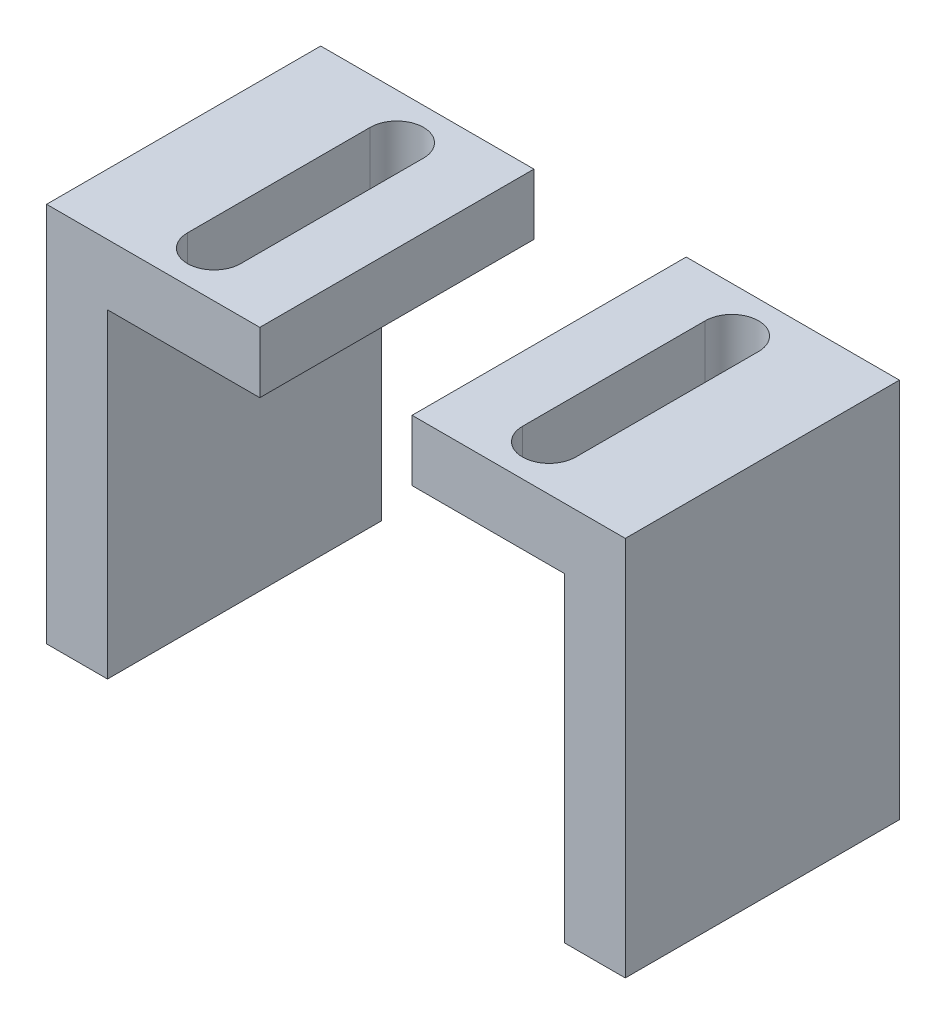
ISO-10303-21;
HEADER;
FILE_DESCRIPTION(('STEP AP214'),'2;1');
FILE_NAME('part.step','',(''),(''),'','','');
FILE_SCHEMA(('AUTOMOTIVE_DESIGN { 1 0 10303 214 1 1 1 1 }'));
ENDSEC;
DATA;
#1=APPLICATION_CONTEXT('core data for automotive mechanical design processes');
#2=APPLICATION_PROTOCOL_DEFINITION('international standard','automotive_design',2000,#1);
#3=PRODUCT_CONTEXT('',#1,'mechanical');
#4=PRODUCT('Part','Part','',(#3));
#5=PRODUCT_RELATED_PRODUCT_CATEGORY('part','',(#4));
#6=PRODUCT_DEFINITION_FORMATION('','',#4);
#7=PRODUCT_DEFINITION_CONTEXT('part definition',#1,'design');
#8=PRODUCT_DEFINITION('design','',#6,#7);
#9=PRODUCT_DEFINITION_SHAPE('','',#8);
#10=(LENGTH_UNIT() NAMED_UNIT(*) SI_UNIT(.MILLI.,.METRE.));
#11=(NAMED_UNIT(*) PLANE_ANGLE_UNIT() SI_UNIT($,.RADIAN.));
#12=(NAMED_UNIT(*) SI_UNIT($,.STERADIAN.) SOLID_ANGLE_UNIT());
#13=UNCERTAINTY_MEASURE_WITH_UNIT(LENGTH_MEASURE(1.E-05),#10,'distance_accuracy_value','');
#14=(GEOMETRIC_REPRESENTATION_CONTEXT(3) GLOBAL_UNCERTAINTY_ASSIGNED_CONTEXT((#13)) GLOBAL_UNIT_ASSIGNED_CONTEXT((#10,
#11,#12)) REPRESENTATION_CONTEXT('',''));
#15=CARTESIAN_POINT('',(0.,0.,0.));
#16=DIRECTION('',(0.,0.,1.));
#17=DIRECTION('',(1.,0.,0.));
#18=AXIS2_PLACEMENT_3D('',#15,#16,#17);
#19=CARTESIAN_POINT('',(10.,4.,18.));
#20=DIRECTION('',(1.,0.,0.));
#21=DIRECTION('',(0.,-1.,0.));
#22=AXIS2_PLACEMENT_3D('',#19,#20,#21);
#23=PLANE('',#22);
#24=DIRECTION('',(0.,1.,0.));
#25=VECTOR('',#24,1.);
#26=CARTESIAN_POINT('',(10.,4.,0.));
#27=LINE('',#26,#25);
#28=CARTESIAN_POINT('',(10.,0.,0.));
#29=VERTEX_POINT('',#28);
#30=CARTESIAN_POINT('',(10.,4.,0.));
#31=VERTEX_POINT('',#30);
#32=EDGE_CURVE('E143',#29,#31,#27,.T.);
#33=ORIENTED_EDGE('',*,*,#32,.F.);
#34=DIRECTION('',(0.,0.,-1.));
#35=VECTOR('',#34,1.);
#36=CARTESIAN_POINT('',(10.,0.,18.));
#37=LINE('',#36,#35);
#38=CARTESIAN_POINT('',(10.,0.,18.));
#39=VERTEX_POINT('',#38);
#40=EDGE_CURVE('E164',#39,#29,#37,.T.);
#41=ORIENTED_EDGE('',*,*,#40,.F.);
#42=DIRECTION('',(0.,1.,0.));
#43=VECTOR('',#42,1.);
#44=CARTESIAN_POINT('',(10.,4.,18.));
#45=LINE('',#44,#43);
#46=CARTESIAN_POINT('',(10.,4.,18.));
#47=VERTEX_POINT('',#46);
#48=EDGE_CURVE('E146',#39,#47,#45,.T.);
#49=ORIENTED_EDGE('',*,*,#48,.T.);
#50=DIRECTION('',(0.,0.,-1.));
#51=VECTOR('',#50,1.);
#52=CARTESIAN_POINT('',(10.,4.,18.));
#53=LINE('',#52,#51);
#54=EDGE_CURVE('E194',#47,#31,#53,.T.);
#55=ORIENTED_EDGE('',*,*,#54,.T.);
#56=EDGE_LOOP('',(#33,#41,#49,#55));
#57=FACE_BOUND('',#56,.T.);
#58=ADVANCED_FACE('F42',(#57),#23,.F.);
#59=CARTESIAN_POINT('',(24.,4.,18.));
#60=DIRECTION('',(0.,-1.,0.));
#61=DIRECTION('',(0.,0.,-1.));
#62=AXIS2_PLACEMENT_3D('',#59,#60,#61);
#63=PLANE('',#62);
#64=DIRECTION('',(0.,0.,1.));
#65=VECTOR('',#64,1.);
#66=CARTESIAN_POINT('',(17.75,4.,3.));
#67=LINE('',#66,#65);
#68=CARTESIAN_POINT('',(17.75,4.,3.));
#69=VERTEX_POINT('',#68);
#70=CARTESIAN_POINT('',(17.75,4.,15.));
#71=VERTEX_POINT('',#70);
#72=EDGE_CURVE('E120',#69,#71,#67,.T.);
#73=ORIENTED_EDGE('',*,*,#72,.T.);
#74=CARTESIAN_POINT('',(16.,4.,15.));
#75=DIRECTION('',(0.,-1.,0.));
#76=DIRECTION('',(0.,0.,1.));
#77=AXIS2_PLACEMENT_3D('',#74,#75,#76);
#78=CIRCLE('',#77,1.75);
#79=CARTESIAN_POINT('',(14.25,4.,15.));
#80=VERTEX_POINT('',#79);
#81=EDGE_CURVE('E127',#71,#80,#78,.T.);
#82=ORIENTED_EDGE('',*,*,#81,.T.);
#83=DIRECTION('',(0.,0.,-1.));
#84=VECTOR('',#83,1.);
#85=CARTESIAN_POINT('',(14.25,4.,3.));
#86=LINE('',#85,#84);
#87=CARTESIAN_POINT('',(14.25,4.,3.));
#88=VERTEX_POINT('',#87);
#89=EDGE_CURVE('E132',#80,#88,#86,.T.);
#90=ORIENTED_EDGE('',*,*,#89,.T.);
#91=CARTESIAN_POINT('',(16.,4.,3.));
#92=DIRECTION('',(0.,-1.,0.));
#93=DIRECTION('',(0.,0.,1.));
#94=AXIS2_PLACEMENT_3D('',#91,#92,#93);
#95=CIRCLE('',#94,1.75);
#96=EDGE_CURVE('E136',#88,#69,#95,.T.);
#97=ORIENTED_EDGE('',*,*,#96,.T.);
#98=EDGE_LOOP('',(#73,#82,#90,#97));
#99=FACE_BOUND('',#98,.T.);
#100=DIRECTION('',(1.,0.,0.));
#101=VECTOR('',#100,1.);
#102=CARTESIAN_POINT('',(24.,4.,0.));
#103=LINE('',#102,#101);
#104=CARTESIAN_POINT('',(24.,4.,0.));
#105=VERTEX_POINT('',#104);
#106=EDGE_CURVE('E167',#31,#105,#103,.T.);
#107=ORIENTED_EDGE('',*,*,#106,.F.);
#108=ORIENTED_EDGE('',*,*,#54,.F.);
#109=DIRECTION('',(1.,0.,0.));
#110=VECTOR('',#109,1.);
#111=CARTESIAN_POINT('',(24.,4.,18.));
#112=LINE('',#111,#110);
#113=CARTESIAN_POINT('',(24.,4.,18.));
#114=VERTEX_POINT('',#113);
#115=EDGE_CURVE('E149',#47,#114,#112,.T.);
#116=ORIENTED_EDGE('',*,*,#115,.T.);
#117=DIRECTION('',(0.,0.,-1.));
#118=VECTOR('',#117,1.);
#119=CARTESIAN_POINT('',(24.,4.,18.));
#120=LINE('',#119,#118);
#121=EDGE_CURVE('E191',#114,#105,#120,.T.);
#122=ORIENTED_EDGE('',*,*,#121,.T.);
#123=EDGE_LOOP('',(#107,#108,#116,#122));
#124=FACE_BOUND('',#123,.T.);
#125=ADVANCED_FACE('F134',(#99,#124),#63,.F.);
#126=CARTESIAN_POINT('',(24.,-21.,18.));
#127=DIRECTION('',(-1.,0.,0.));
#128=DIRECTION('',(0.,0.,-1.));
#129=AXIS2_PLACEMENT_3D('',#126,#127,#128);
#130=PLANE('',#129);
#131=DIRECTION('',(0.,-1.,0.));
#132=VECTOR('',#131,1.);
#133=CARTESIAN_POINT('',(24.,-21.,0.));
#134=LINE('',#133,#132);
#135=CARTESIAN_POINT('',(24.,-21.,0.));
#136=VERTEX_POINT('',#135);
#137=EDGE_CURVE('E170',#105,#136,#134,.T.);
#138=ORIENTED_EDGE('',*,*,#137,.F.);
#139=ORIENTED_EDGE('',*,*,#121,.F.);
#140=DIRECTION('',(0.,-1.,0.));
#141=VECTOR('',#140,1.);
#142=CARTESIAN_POINT('',(24.,-21.,18.));
#143=LINE('',#142,#141);
#144=CARTESIAN_POINT('',(24.,-21.,18.));
#145=VERTEX_POINT('',#144);
#146=EDGE_CURVE('E153',#114,#145,#143,.T.);
#147=ORIENTED_EDGE('',*,*,#146,.T.);
#148=DIRECTION('',(0.,0.,-1.));
#149=VECTOR('',#148,1.);
#150=CARTESIAN_POINT('',(24.,-21.,18.));
#151=LINE('',#150,#149);
#152=EDGE_CURVE('E188',#145,#136,#151,.T.);
#153=ORIENTED_EDGE('',*,*,#152,.T.);
#154=EDGE_LOOP('',(#138,#139,#147,#153));
#155=FACE_BOUND('',#154,.T.);
#156=ADVANCED_FACE('F226',(#155),#130,.F.);
#157=CARTESIAN_POINT('',(20.,-21.,18.));
#158=DIRECTION('',(0.,1.,0.));
#159=DIRECTION('',(1.,0.,0.));
#160=AXIS2_PLACEMENT_3D('',#157,#158,#159);
#161=PLANE('',#160);
#162=DIRECTION('',(-1.,0.,0.));
#163=VECTOR('',#162,1.);
#164=CARTESIAN_POINT('',(20.,-21.,0.));
#165=LINE('',#164,#163);
#166=CARTESIAN_POINT('',(20.,-21.,0.));
#167=VERTEX_POINT('',#166);
#168=EDGE_CURVE('E173',#136,#167,#165,.T.);
#169=ORIENTED_EDGE('',*,*,#168,.F.);
#170=ORIENTED_EDGE('',*,*,#152,.F.);
#171=DIRECTION('',(-1.,0.,0.));
#172=VECTOR('',#171,1.);
#173=CARTESIAN_POINT('',(20.,-21.,18.));
#174=LINE('',#173,#172);
#175=CARTESIAN_POINT('',(20.,-21.,18.));
#176=VERTEX_POINT('',#175);
#177=EDGE_CURVE('E156',#145,#176,#174,.T.);
#178=ORIENTED_EDGE('',*,*,#177,.T.);
#179=DIRECTION('',(0.,0.,-1.));
#180=VECTOR('',#179,1.);
#181=CARTESIAN_POINT('',(20.,-21.,18.));
#182=LINE('',#181,#180);
#183=EDGE_CURVE('E185',#176,#167,#182,.T.);
#184=ORIENTED_EDGE('',*,*,#183,.T.);
#185=EDGE_LOOP('',(#169,#170,#178,#184));
#186=FACE_BOUND('',#185,.T.);
#187=ADVANCED_FACE('F237',(#186),#161,.F.);
#188=CARTESIAN_POINT('',(20.,0.,18.));
#189=DIRECTION('',(1.,0.,0.));
#190=DIRECTION('',(0.,-1.,0.));
#191=AXIS2_PLACEMENT_3D('',#188,#189,#190);
#192=PLANE('',#191);
#193=DIRECTION('',(0.,1.,0.));
#194=VECTOR('',#193,1.);
#195=CARTESIAN_POINT('',(20.,0.,0.));
#196=LINE('',#195,#194);
#197=CARTESIAN_POINT('',(20.,0.,0.));
#198=VERTEX_POINT('',#197);
#199=EDGE_CURVE('E176',#167,#198,#196,.T.);
#200=ORIENTED_EDGE('',*,*,#199,.F.);
#201=ORIENTED_EDGE('',*,*,#183,.F.);
#202=DIRECTION('',(0.,1.,0.));
#203=VECTOR('',#202,1.);
#204=CARTESIAN_POINT('',(20.,0.,18.));
#205=LINE('',#204,#203);
#206=CARTESIAN_POINT('',(20.,0.,18.));
#207=VERTEX_POINT('',#206);
#208=EDGE_CURVE('E159',#176,#207,#205,.T.);
#209=ORIENTED_EDGE('',*,*,#208,.T.);
#210=DIRECTION('',(0.,0.,-1.));
#211=VECTOR('',#210,1.);
#212=CARTESIAN_POINT('',(20.,0.,18.));
#213=LINE('',#212,#211);
#214=EDGE_CURVE('E182',#207,#198,#213,.T.);
#215=ORIENTED_EDGE('',*,*,#214,.T.);
#216=EDGE_LOOP('',(#200,#201,#209,#215));
#217=FACE_BOUND('',#216,.T.);
#218=ADVANCED_FACE('F240',(#217),#192,.F.);
#219=CARTESIAN_POINT('',(10.,0.,18.));
#220=DIRECTION('',(0.,1.,0.));
#221=DIRECTION('',(1.,0.,0.));
#222=AXIS2_PLACEMENT_3D('',#219,#220,#221);
#223=PLANE('',#222);
#224=DIRECTION('',(0.,0.,-1.));
#225=VECTOR('',#224,1.);
#226=CARTESIAN_POINT('',(14.25,0.,18.));
#227=LINE('',#226,#225);
#228=CARTESIAN_POINT('',(14.25,0.,15.));
#229=VERTEX_POINT('',#228);
#230=CARTESIAN_POINT('',(14.25,0.,3.));
#231=VERTEX_POINT('',#230);
#232=EDGE_CURVE('E49',#229,#231,#227,.T.);
#233=ORIENTED_EDGE('',*,*,#232,.F.);
#234=CARTESIAN_POINT('',(16.,0.,15.));
#235=DIRECTION('',(0.,-1.,0.));
#236=DIRECTION('',(1.,0.,0.));
#237=AXIS2_PLACEMENT_3D('',#234,#235,#236);
#238=CIRCLE('',#237,1.75);
#239=CARTESIAN_POINT('',(17.75,0.,15.));
#240=VERTEX_POINT('',#239);
#241=EDGE_CURVE('E198',#240,#229,#238,.T.);
#242=ORIENTED_EDGE('',*,*,#241,.F.);
#243=DIRECTION('',(0.,0.,1.));
#244=VECTOR('',#243,1.);
#245=CARTESIAN_POINT('',(17.75,0.,18.));
#246=LINE('',#245,#244);
#247=CARTESIAN_POINT('',(17.75,0.,3.));
#248=VERTEX_POINT('',#247);
#249=EDGE_CURVE('E122',#248,#240,#246,.T.);
#250=ORIENTED_EDGE('',*,*,#249,.F.);
#251=CARTESIAN_POINT('',(16.,0.,3.));
#252=DIRECTION('',(0.,-1.,0.));
#253=DIRECTION('',(1.,0.,0.));
#254=AXIS2_PLACEMENT_3D('',#251,#252,#253);
#255=CIRCLE('',#254,1.75);
#256=EDGE_CURVE('E12',#231,#248,#255,.T.);
#257=ORIENTED_EDGE('',*,*,#256,.F.);
#258=EDGE_LOOP('',(#233,#242,#250,#257));
#259=FACE_BOUND('',#258,.T.);
#260=DIRECTION('',(-1.,0.,0.));
#261=VECTOR('',#260,1.);
#262=CARTESIAN_POINT('',(10.,0.,0.));
#263=LINE('',#262,#261);
#264=EDGE_CURVE('E150',#198,#29,#263,.T.);
#265=ORIENTED_EDGE('',*,*,#264,.F.);
#266=ORIENTED_EDGE('',*,*,#214,.F.);
#267=DIRECTION('',(-1.,0.,0.));
#268=VECTOR('',#267,1.);
#269=CARTESIAN_POINT('',(10.,0.,18.));
#270=LINE('',#269,#268);
#271=EDGE_CURVE('E162',#207,#39,#270,.T.);
#272=ORIENTED_EDGE('',*,*,#271,.T.);
#273=ORIENTED_EDGE('',*,*,#40,.T.);
#274=EDGE_LOOP('',(#265,#266,#272,#273));
#275=FACE_BOUND('',#274,.T.);
#276=ADVANCED_FACE('F205',(#259,#275),#223,.F.);
#277=CARTESIAN_POINT('',(10.,0.,18.));
#278=DIRECTION('',(0.,0.,-1.));
#279=DIRECTION('',(1.,0.,0.));
#280=AXIS2_PLACEMENT_3D('',#277,#278,#279);
#281=PLANE('',#280);
#282=ORIENTED_EDGE('',*,*,#48,.F.);
#283=ORIENTED_EDGE('',*,*,#271,.F.);
#284=ORIENTED_EDGE('',*,*,#208,.F.);
#285=ORIENTED_EDGE('',*,*,#177,.F.);
#286=ORIENTED_EDGE('',*,*,#146,.F.);
#287=ORIENTED_EDGE('',*,*,#115,.F.);
#288=EDGE_LOOP('',(#282,#283,#284,#285,#286,#287));
#289=FACE_BOUND('',#288,.T.);
#290=ADVANCED_FACE('F216',(#289),#281,.F.);
#291=CARTESIAN_POINT('',(10.,0.,0.));
#292=DIRECTION('',(0.,0.,-1.));
#293=DIRECTION('',(1.,0.,0.));
#294=AXIS2_PLACEMENT_3D('',#291,#292,#293);
#295=PLANE('',#294);
#296=ORIENTED_EDGE('',*,*,#32,.T.);
#297=ORIENTED_EDGE('',*,*,#106,.T.);
#298=ORIENTED_EDGE('',*,*,#137,.T.);
#299=ORIENTED_EDGE('',*,*,#168,.T.);
#300=ORIENTED_EDGE('',*,*,#199,.T.);
#301=ORIENTED_EDGE('',*,*,#264,.T.);
#302=EDGE_LOOP('',(#296,#297,#298,#299,#300,#301));
#303=FACE_BOUND('',#302,.T.);
#304=ADVANCED_FACE('F209',(#303),#295,.T.);
#305=CARTESIAN_POINT('',(16.,-14.,3.));
#306=DIRECTION('',(0.,1.,0.));
#307=DIRECTION('',(0.,0.,1.));
#308=AXIS2_PLACEMENT_3D('',#305,#306,#307);
#309=CYLINDRICAL_SURFACE('',#308,1.75);
#310=DIRECTION('',(0.,1.,0.));
#311=VECTOR('',#310,1.);
#312=CARTESIAN_POINT('',(14.25,-14.,3.));
#313=LINE('',#312,#311);
#314=EDGE_CURVE('E141',#231,#88,#313,.T.);
#315=ORIENTED_EDGE('',*,*,#314,.F.);
#316=ORIENTED_EDGE('',*,*,#256,.T.);
#317=DIRECTION('',(0.,1.,0.));
#318=VECTOR('',#317,1.);
#319=CARTESIAN_POINT('',(17.75,-14.,3.));
#320=LINE('',#319,#318);
#321=EDGE_CURVE('E55',#248,#69,#320,.T.);
#322=ORIENTED_EDGE('',*,*,#321,.T.);
#323=ORIENTED_EDGE('',*,*,#96,.F.);
#324=EDGE_LOOP('',(#315,#316,#322,#323));
#325=FACE_BOUND('',#324,.T.);
#326=ADVANCED_FACE('F207',(#325),#309,.F.);
#327=CARTESIAN_POINT('',(14.25,-14.,3.));
#328=DIRECTION('',(-1.,0.,0.));
#329=DIRECTION('',(0.,0.,-1.));
#330=AXIS2_PLACEMENT_3D('',#327,#328,#329);
#331=PLANE('',#330);
#332=DIRECTION('',(0.,1.,0.));
#333=VECTOR('',#332,1.);
#334=CARTESIAN_POINT('',(14.25,-14.,15.));
#335=LINE('',#334,#333);
#336=EDGE_CURVE('E124',#229,#80,#335,.T.);
#337=ORIENTED_EDGE('',*,*,#336,.F.);
#338=ORIENTED_EDGE('',*,*,#232,.T.);
#339=ORIENTED_EDGE('',*,*,#314,.T.);
#340=ORIENTED_EDGE('',*,*,#89,.F.);
#341=EDGE_LOOP('',(#337,#338,#339,#340));
#342=FACE_BOUND('',#341,.T.);
#343=ADVANCED_FACE('F202',(#342),#331,.F.);
#344=CARTESIAN_POINT('',(16.,-14.,15.));
#345=DIRECTION('',(0.,1.,0.));
#346=DIRECTION('',(0.,0.,1.));
#347=AXIS2_PLACEMENT_3D('',#344,#345,#346);
#348=CYLINDRICAL_SURFACE('',#347,1.75);
#349=DIRECTION('',(0.,1.,0.));
#350=VECTOR('',#349,1.);
#351=CARTESIAN_POINT('',(17.75,-14.,15.));
#352=LINE('',#351,#350);
#353=EDGE_CURVE('E63',#240,#71,#352,.T.);
#354=ORIENTED_EDGE('',*,*,#353,.F.);
#355=ORIENTED_EDGE('',*,*,#241,.T.);
#356=ORIENTED_EDGE('',*,*,#336,.T.);
#357=ORIENTED_EDGE('',*,*,#81,.F.);
#358=EDGE_LOOP('',(#354,#355,#356,#357));
#359=FACE_BOUND('',#358,.T.);
#360=ADVANCED_FACE('F128',(#359),#348,.F.);
#361=CARTESIAN_POINT('',(17.75,-14.,3.));
#362=DIRECTION('',(1.,0.,0.));
#363=DIRECTION('',(0.,0.,1.));
#364=AXIS2_PLACEMENT_3D('',#361,#362,#363);
#365=PLANE('',#364);
#366=ORIENTED_EDGE('',*,*,#321,.F.);
#367=ORIENTED_EDGE('',*,*,#249,.T.);
#368=ORIENTED_EDGE('',*,*,#353,.T.);
#369=ORIENTED_EDGE('',*,*,#72,.F.);
#370=EDGE_LOOP('',(#366,#367,#368,#369));
#371=FACE_BOUND('',#370,.T.);
#372=ADVANCED_FACE('F118',(#371),#365,.F.);
#373=CLOSED_SHELL('',(#58,#125,#156,#187,#218,#276,#290,#304,#326,#343,#360,#372));
#374=MANIFOLD_SOLID_BREP('B2',#373);
#375=CARTESIAN_POINT('',(0.,4.,18.));
#376=DIRECTION('',(-1.,0.,0.));
#377=DIRECTION('',(0.,-1.,0.));
#378=AXIS2_PLACEMENT_3D('',#375,#376,#377);
#379=PLANE('',#378);
#380=DIRECTION('',(0.,1.,0.));
#381=VECTOR('',#380,1.);
#382=CARTESIAN_POINT('',(0.,4.,0.));
#383=LINE('',#382,#381);
#384=CARTESIAN_POINT('',(0.,0.,0.));
#385=VERTEX_POINT('',#384);
#386=CARTESIAN_POINT('',(0.,4.,0.));
#387=VERTEX_POINT('',#386);
#388=EDGE_CURVE('E425',#385,#387,#383,.T.);
#389=ORIENTED_EDGE('',*,*,#388,.T.);
#390=DIRECTION('',(0.,0.,-1.));
#391=VECTOR('',#390,1.);
#392=CARTESIAN_POINT('',(0.,4.,18.));
#393=LINE('',#392,#391);
#394=CARTESIAN_POINT('',(0.,4.,18.));
#395=VERTEX_POINT('',#394);
#396=EDGE_CURVE('E468',#395,#387,#393,.T.);
#397=ORIENTED_EDGE('',*,*,#396,.F.);
#398=DIRECTION('',(0.,1.,0.));
#399=VECTOR('',#398,1.);
#400=CARTESIAN_POINT('',(0.,4.,18.));
#401=LINE('',#400,#399);
#402=CARTESIAN_POINT('',(0.,0.,18.));
#403=VERTEX_POINT('',#402);
#404=EDGE_CURVE('E428',#403,#395,#401,.T.);
#405=ORIENTED_EDGE('',*,*,#404,.F.);
#406=DIRECTION('',(0.,0.,-1.));
#407=VECTOR('',#406,1.);
#408=CARTESIAN_POINT('',(0.,0.,18.));
#409=LINE('',#408,#407);
#410=EDGE_CURVE('E442',#403,#385,#409,.T.);
#411=ORIENTED_EDGE('',*,*,#410,.T.);
#412=EDGE_LOOP('',(#389,#397,#405,#411));
#413=FACE_BOUND('',#412,.T.);
#414=ADVANCED_FACE('F323',(#413),#379,.F.);
#415=CARTESIAN_POINT('',(-14.,4.,18.));
#416=DIRECTION('',(0.,-1.,0.));
#417=DIRECTION('',(0.,0.,-1.));
#418=AXIS2_PLACEMENT_3D('',#415,#416,#417);
#419=PLANE('',#418);
#420=DIRECTION('',(0.,0.,1.));
#421=VECTOR('',#420,1.);
#422=CARTESIAN_POINT('',(-7.75,4.,3.));
#423=LINE('',#422,#421);
#424=CARTESIAN_POINT('',(-7.75,4.,3.));
#425=VERTEX_POINT('',#424);
#426=CARTESIAN_POINT('',(-7.75,4.,15.));
#427=VERTEX_POINT('',#426);
#428=EDGE_CURVE('E411',#425,#427,#423,.T.);
#429=ORIENTED_EDGE('',*,*,#428,.F.);
#430=CARTESIAN_POINT('',(-6.,4.,3.));
#431=DIRECTION('',(0.,1.,0.));
#432=DIRECTION('',(0.,0.,1.));
#433=AXIS2_PLACEMENT_3D('',#430,#431,#432);
#434=CIRCLE('',#433,1.75);
#435=CARTESIAN_POINT('',(-4.25,4.,3.));
#436=VERTEX_POINT('',#435);
#437=EDGE_CURVE('E337',#436,#425,#434,.T.);
#438=ORIENTED_EDGE('',*,*,#437,.F.);
#439=DIRECTION('',(0.,0.,-1.));
#440=VECTOR('',#439,1.);
#441=CARTESIAN_POINT('',(-4.25,4.,3.));
#442=LINE('',#441,#440);
#443=CARTESIAN_POINT('',(-4.25,4.,15.));
#444=VERTEX_POINT('',#443);
#445=EDGE_CURVE('E418',#444,#436,#442,.T.);
#446=ORIENTED_EDGE('',*,*,#445,.F.);
#447=CARTESIAN_POINT('',(-6.,4.,15.));
#448=DIRECTION('',(0.,1.,0.));
#449=DIRECTION('',(0.,0.,1.));
#450=AXIS2_PLACEMENT_3D('',#447,#448,#449);
#451=CIRCLE('',#450,1.75);
#452=EDGE_CURVE('E402',#427,#444,#451,.T.);
#453=ORIENTED_EDGE('',*,*,#452,.F.);
#454=EDGE_LOOP('',(#429,#438,#446,#453));
#455=FACE_BOUND('',#454,.T.);
#456=DIRECTION('',(-1.,0.,0.));
#457=VECTOR('',#456,1.);
#458=CARTESIAN_POINT('',(-14.,4.,0.));
#459=LINE('',#458,#457);
#460=CARTESIAN_POINT('',(-14.,4.,0.));
#461=VERTEX_POINT('',#460);
#462=EDGE_CURVE('E445',#387,#461,#459,.T.);
#463=ORIENTED_EDGE('',*,*,#462,.T.);
#464=DIRECTION('',(0.,0.,-1.));
#465=VECTOR('',#464,1.);
#466=CARTESIAN_POINT('',(-14.,4.,18.));
#467=LINE('',#466,#465);
#468=CARTESIAN_POINT('',(-14.,4.,18.));
#469=VERTEX_POINT('',#468);
#470=EDGE_CURVE('E465',#469,#461,#467,.T.);
#471=ORIENTED_EDGE('',*,*,#470,.F.);
#472=DIRECTION('',(-1.,0.,0.));
#473=VECTOR('',#472,1.);
#474=CARTESIAN_POINT('',(-14.,4.,18.));
#475=LINE('',#474,#473);
#476=EDGE_CURVE('E431',#395,#469,#475,.T.);
#477=ORIENTED_EDGE('',*,*,#476,.F.);
#478=ORIENTED_EDGE('',*,*,#396,.T.);
#479=EDGE_LOOP('',(#463,#471,#477,#478));
#480=FACE_BOUND('',#479,.T.);
#481=ADVANCED_FACE('F415',(#455,#480),#419,.F.);
#482=CARTESIAN_POINT('',(-14.,-21.,18.));
#483=DIRECTION('',(1.,0.,0.));
#484=DIRECTION('',(0.,0.,-1.));
#485=AXIS2_PLACEMENT_3D('',#482,#483,#484);
#486=PLANE('',#485);
#487=DIRECTION('',(0.,-1.,0.));
#488=VECTOR('',#487,1.);
#489=CARTESIAN_POINT('',(-14.,-21.,0.));
#490=LINE('',#489,#488);
#491=CARTESIAN_POINT('',(-14.,-21.,0.));
#492=VERTEX_POINT('',#491);
#493=EDGE_CURVE('E447',#461,#492,#490,.T.);
#494=ORIENTED_EDGE('',*,*,#493,.T.);
#495=DIRECTION('',(0.,0.,-1.));
#496=VECTOR('',#495,1.);
#497=CARTESIAN_POINT('',(-14.,-21.,18.));
#498=LINE('',#497,#496);
#499=CARTESIAN_POINT('',(-14.,-21.,18.));
#500=VERTEX_POINT('',#499);
#501=EDGE_CURVE('E462',#500,#492,#498,.T.);
#502=ORIENTED_EDGE('',*,*,#501,.F.);
#503=DIRECTION('',(0.,-1.,0.));
#504=VECTOR('',#503,1.);
#505=CARTESIAN_POINT('',(-14.,-21.,18.));
#506=LINE('',#505,#504);
#507=EDGE_CURVE('E434',#469,#500,#506,.T.);
#508=ORIENTED_EDGE('',*,*,#507,.F.);
#509=ORIENTED_EDGE('',*,*,#470,.T.);
#510=EDGE_LOOP('',(#494,#502,#508,#509));
#511=FACE_BOUND('',#510,.T.);
#512=ADVANCED_FACE('F499',(#511),#486,.F.);
#513=CARTESIAN_POINT('',(-10.,-21.,18.));
#514=DIRECTION('',(0.,1.,0.));
#515=DIRECTION('',(-1.,0.,0.));
#516=AXIS2_PLACEMENT_3D('',#513,#514,#515);
#517=PLANE('',#516);
#518=DIRECTION('',(1.,0.,0.));
#519=VECTOR('',#518,1.);
#520=CARTESIAN_POINT('',(-10.,-21.,0.));
#521=LINE('',#520,#519);
#522=CARTESIAN_POINT('',(-10.,-21.,0.));
#523=VERTEX_POINT('',#522);
#524=EDGE_CURVE('E449',#492,#523,#521,.T.);
#525=ORIENTED_EDGE('',*,*,#524,.T.);
#526=DIRECTION('',(0.,0.,-1.));
#527=VECTOR('',#526,1.);
#528=CARTESIAN_POINT('',(-10.,-21.,18.));
#529=LINE('',#528,#527);
#530=CARTESIAN_POINT('',(-10.,-21.,18.));
#531=VERTEX_POINT('',#530);
#532=EDGE_CURVE('E459',#531,#523,#529,.T.);
#533=ORIENTED_EDGE('',*,*,#532,.F.);
#534=DIRECTION('',(1.,0.,0.));
#535=VECTOR('',#534,1.);
#536=CARTESIAN_POINT('',(-10.,-21.,18.));
#537=LINE('',#536,#535);
#538=EDGE_CURVE('E436',#500,#531,#537,.T.);
#539=ORIENTED_EDGE('',*,*,#538,.F.);
#540=ORIENTED_EDGE('',*,*,#501,.T.);
#541=EDGE_LOOP('',(#525,#533,#539,#540));
#542=FACE_BOUND('',#541,.T.);
#543=ADVANCED_FACE('F518',(#542),#517,.F.);
#544=CARTESIAN_POINT('',(-10.,0.,18.));
#545=DIRECTION('',(-1.,0.,0.));
#546=DIRECTION('',(0.,-1.,0.));
#547=AXIS2_PLACEMENT_3D('',#544,#545,#546);
#548=PLANE('',#547);
#549=DIRECTION('',(0.,1.,0.));
#550=VECTOR('',#549,1.);
#551=CARTESIAN_POINT('',(-10.,0.,0.));
#552=LINE('',#551,#550);
#553=CARTESIAN_POINT('',(-10.,0.,0.));
#554=VERTEX_POINT('',#553);
#555=EDGE_CURVE('E451',#523,#554,#552,.T.);
#556=ORIENTED_EDGE('',*,*,#555,.T.);
#557=DIRECTION('',(0.,0.,-1.));
#558=VECTOR('',#557,1.);
#559=CARTESIAN_POINT('',(-10.,0.,18.));
#560=LINE('',#559,#558);
#561=CARTESIAN_POINT('',(-10.,0.,18.));
#562=VERTEX_POINT('',#561);
#563=EDGE_CURVE('E456',#562,#554,#560,.T.);
#564=ORIENTED_EDGE('',*,*,#563,.F.);
#565=DIRECTION('',(0.,1.,0.));
#566=VECTOR('',#565,1.);
#567=CARTESIAN_POINT('',(-10.,0.,18.));
#568=LINE('',#567,#566);
#569=EDGE_CURVE('E438',#531,#562,#568,.T.);
#570=ORIENTED_EDGE('',*,*,#569,.F.);
#571=ORIENTED_EDGE('',*,*,#532,.T.);
#572=EDGE_LOOP('',(#556,#564,#570,#571));
#573=FACE_BOUND('',#572,.T.);
#574=ADVANCED_FACE('F515',(#573),#548,.F.);
#575=CARTESIAN_POINT('',(0.,0.,18.));
#576=DIRECTION('',(0.,1.,0.));
#577=DIRECTION('',(-1.,0.,0.));
#578=AXIS2_PLACEMENT_3D('',#575,#576,#577);
#579=PLANE('',#578);
#580=DIRECTION('',(0.,0.,-1.));
#581=VECTOR('',#580,1.);
#582=CARTESIAN_POINT('',(-4.25,0.,18.));
#583=LINE('',#582,#581);
#584=CARTESIAN_POINT('',(-4.25,0.,15.));
#585=VERTEX_POINT('',#584);
#586=CARTESIAN_POINT('',(-4.25,0.,3.));
#587=VERTEX_POINT('',#586);
#588=EDGE_CURVE('E330',#585,#587,#583,.T.);
#589=ORIENTED_EDGE('',*,*,#588,.T.);
#590=CARTESIAN_POINT('',(-6.,0.,3.));
#591=DIRECTION('',(0.,1.,0.));
#592=DIRECTION('',(-1.,0.,0.));
#593=AXIS2_PLACEMENT_3D('',#590,#591,#592);
#594=CIRCLE('',#593,1.75);
#595=CARTESIAN_POINT('',(-7.75,0.,3.));
#596=VERTEX_POINT('',#595);
#597=EDGE_CURVE('E40',#587,#596,#594,.T.);
#598=ORIENTED_EDGE('',*,*,#597,.T.);
#599=DIRECTION('',(0.,0.,1.));
#600=VECTOR('',#599,1.);
#601=CARTESIAN_POINT('',(-7.75,0.,18.));
#602=LINE('',#601,#600);
#603=CARTESIAN_POINT('',(-7.75,0.,15.));
#604=VERTEX_POINT('',#603);
#605=EDGE_CURVE('E471',#596,#604,#602,.T.);
#606=ORIENTED_EDGE('',*,*,#605,.T.);
#607=CARTESIAN_POINT('',(-6.,0.,15.));
#608=DIRECTION('',(0.,1.,0.));
#609=DIRECTION('',(-1.,0.,0.));
#610=AXIS2_PLACEMENT_3D('',#607,#608,#609);
#611=CIRCLE('',#610,1.75);
#612=EDGE_CURVE('E405',#604,#585,#611,.T.);
#613=ORIENTED_EDGE('',*,*,#612,.T.);
#614=EDGE_LOOP('',(#589,#598,#606,#613));
#615=FACE_BOUND('',#614,.T.);
#616=DIRECTION('',(1.,0.,0.));
#617=VECTOR('',#616,1.);
#618=CARTESIAN_POINT('',(0.,0.,0.));
#619=LINE('',#618,#617);
#620=EDGE_CURVE('E432',#554,#385,#619,.T.);
#621=ORIENTED_EDGE('',*,*,#620,.T.);
#622=ORIENTED_EDGE('',*,*,#410,.F.);
#623=DIRECTION('',(1.,0.,0.));
#624=VECTOR('',#623,1.);
#625=CARTESIAN_POINT('',(0.,0.,18.));
#626=LINE('',#625,#624);
#627=EDGE_CURVE('E440',#562,#403,#626,.T.);
#628=ORIENTED_EDGE('',*,*,#627,.F.);
#629=ORIENTED_EDGE('',*,*,#563,.T.);
#630=EDGE_LOOP('',(#621,#622,#628,#629));
#631=FACE_BOUND('',#630,.T.);
#632=ADVANCED_FACE('F475',(#615,#631),#579,.F.);
#633=CARTESIAN_POINT('',(0.,0.,18.));
#634=DIRECTION('',(0.,0.,-1.));
#635=DIRECTION('',(-1.,0.,0.));
#636=AXIS2_PLACEMENT_3D('',#633,#634,#635);
#637=PLANE('',#636);
#638=ORIENTED_EDGE('',*,*,#404,.T.);
#639=ORIENTED_EDGE('',*,*,#476,.T.);
#640=ORIENTED_EDGE('',*,*,#507,.T.);
#641=ORIENTED_EDGE('',*,*,#538,.T.);
#642=ORIENTED_EDGE('',*,*,#569,.T.);
#643=ORIENTED_EDGE('',*,*,#627,.T.);
#644=EDGE_LOOP('',(#638,#639,#640,#641,#642,#643));
#645=FACE_BOUND('',#644,.T.);
#646=ADVANCED_FACE('F489',(#645),#637,.F.);
#647=CARTESIAN_POINT('',(0.,0.,0.));
#648=DIRECTION('',(0.,0.,-1.));
#649=DIRECTION('',(-1.,0.,0.));
#650=AXIS2_PLACEMENT_3D('',#647,#648,#649);
#651=PLANE('',#650);
#652=ORIENTED_EDGE('',*,*,#388,.F.);
#653=ORIENTED_EDGE('',*,*,#620,.F.);
#654=ORIENTED_EDGE('',*,*,#555,.F.);
#655=ORIENTED_EDGE('',*,*,#524,.F.);
#656=ORIENTED_EDGE('',*,*,#493,.F.);
#657=ORIENTED_EDGE('',*,*,#462,.F.);
#658=EDGE_LOOP('',(#652,#653,#654,#655,#656,#657));
#659=FACE_BOUND('',#658,.T.);
#660=ADVANCED_FACE('F482',(#659),#651,.T.);
#661=CARTESIAN_POINT('',(-6.,-14.,3.));
#662=DIRECTION('',(0.,1.,0.));
#663=DIRECTION('',(0.,0.,1.));
#664=AXIS2_PLACEMENT_3D('',#661,#662,#663);
#665=CYLINDRICAL_SURFACE('',#664,1.75);
#666=DIRECTION('',(0.,1.,0.));
#667=VECTOR('',#666,1.);
#668=CARTESIAN_POINT('',(-4.25,-14.,3.));
#669=LINE('',#668,#667);
#670=EDGE_CURVE('E423',#587,#436,#669,.T.);
#671=ORIENTED_EDGE('',*,*,#670,.T.);
#672=ORIENTED_EDGE('',*,*,#437,.T.);
#673=DIRECTION('',(0.,1.,0.));
#674=VECTOR('',#673,1.);
#675=CARTESIAN_POINT('',(-7.75,-14.,3.));
#676=LINE('',#675,#674);
#677=EDGE_CURVE('E408',#596,#425,#676,.T.);
#678=ORIENTED_EDGE('',*,*,#677,.F.);
#679=ORIENTED_EDGE('',*,*,#597,.F.);
#680=EDGE_LOOP('',(#671,#672,#678,#679));
#681=FACE_BOUND('',#680,.T.);
#682=ADVANCED_FACE('F480',(#681),#665,.F.);
#683=CARTESIAN_POINT('',(-4.25,-14.,3.));
#684=DIRECTION('',(1.,0.,0.));
#685=DIRECTION('',(0.,0.,-1.));
#686=AXIS2_PLACEMENT_3D('',#683,#684,#685);
#687=PLANE('',#686);
#688=DIRECTION('',(0.,1.,0.));
#689=VECTOR('',#688,1.);
#690=CARTESIAN_POINT('',(-4.25,-14.,15.));
#691=LINE('',#690,#689);
#692=EDGE_CURVE('E407',#585,#444,#691,.T.);
#693=ORIENTED_EDGE('',*,*,#692,.T.);
#694=ORIENTED_EDGE('',*,*,#445,.T.);
#695=ORIENTED_EDGE('',*,*,#670,.F.);
#696=ORIENTED_EDGE('',*,*,#588,.F.);
#697=EDGE_LOOP('',(#693,#694,#695,#696));
#698=FACE_BOUND('',#697,.T.);
#699=ADVANCED_FACE('F479',(#698),#687,.F.);
#700=CARTESIAN_POINT('',(-6.,-14.,15.));
#701=DIRECTION('',(0.,1.,0.));
#702=DIRECTION('',(0.,0.,1.));
#703=AXIS2_PLACEMENT_3D('',#700,#701,#702);
#704=CYLINDRICAL_SURFACE('',#703,1.75);
#705=DIRECTION('',(0.,1.,0.));
#706=VECTOR('',#705,1.);
#707=CARTESIAN_POINT('',(-7.75,-14.,15.));
#708=LINE('',#707,#706);
#709=EDGE_CURVE('E345',#604,#427,#708,.T.);
#710=ORIENTED_EDGE('',*,*,#709,.T.);
#711=ORIENTED_EDGE('',*,*,#452,.T.);
#712=ORIENTED_EDGE('',*,*,#692,.F.);
#713=ORIENTED_EDGE('',*,*,#612,.F.);
#714=EDGE_LOOP('',(#710,#711,#712,#713));
#715=FACE_BOUND('',#714,.T.);
#716=ADVANCED_FACE('F399',(#715),#704,.F.);
#717=CARTESIAN_POINT('',(-7.75,-14.,3.));
#718=DIRECTION('',(-1.,0.,0.));
#719=DIRECTION('',(0.,0.,1.));
#720=AXIS2_PLACEMENT_3D('',#717,#718,#719);
#721=PLANE('',#720);
#722=ORIENTED_EDGE('',*,*,#677,.T.);
#723=ORIENTED_EDGE('',*,*,#428,.T.);
#724=ORIENTED_EDGE('',*,*,#709,.F.);
#725=ORIENTED_EDGE('',*,*,#605,.F.);
#726=EDGE_LOOP('',(#722,#723,#724,#725));
#727=FACE_BOUND('',#726,.T.);
#728=ADVANCED_FACE('F412',(#727),#721,.F.);
#729=CLOSED_SHELL('',(#414,#481,#512,#543,#574,#632,#646,#660,#682,#699,#716,#728));
#730=MANIFOLD_SOLID_BREP('B6',#729);
#731=ADVANCED_BREP_SHAPE_REPRESENTATION('',(#18,#374,#730),#14);
#732=SHAPE_DEFINITION_REPRESENTATION(#9,#731);
ENDSEC;
END-ISO-10303-21;
